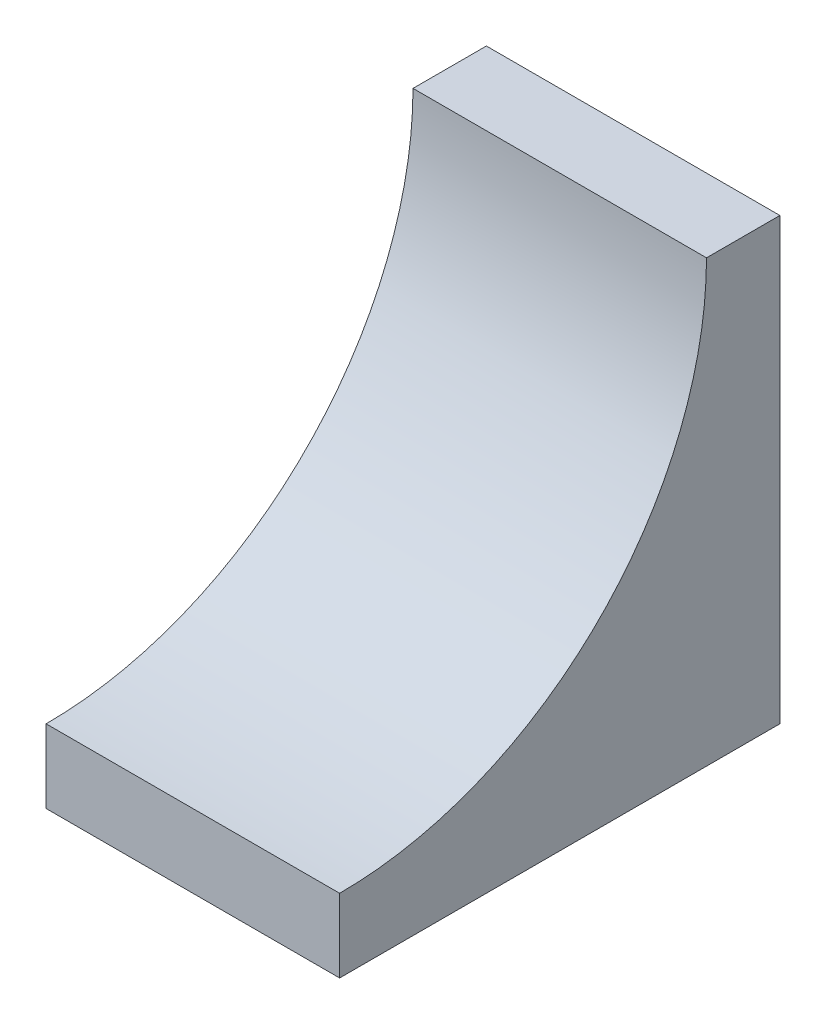
ISO-10303-21;
HEADER;
FILE_DESCRIPTION(('STEP AP214'),'2;1');
FILE_NAME('part.step','',(''),(''),'','','');
FILE_SCHEMA(('AUTOMOTIVE_DESIGN { 1 0 10303 214 1 1 1 1 }'));
ENDSEC;
DATA;
#1=APPLICATION_CONTEXT('core data for automotive mechanical design processes');
#2=APPLICATION_PROTOCOL_DEFINITION('international standard','automotive_design',2000,#1);
#3=PRODUCT_CONTEXT('',#1,'mechanical');
#4=PRODUCT('Part','Part','',(#3));
#5=PRODUCT_RELATED_PRODUCT_CATEGORY('part','',(#4));
#6=PRODUCT_DEFINITION_FORMATION('','',#4);
#7=PRODUCT_DEFINITION_CONTEXT('part definition',#1,'design');
#8=PRODUCT_DEFINITION('design','',#6,#7);
#9=PRODUCT_DEFINITION_SHAPE('','',#8);
#10=(LENGTH_UNIT() NAMED_UNIT(*) SI_UNIT(.MILLI.,.METRE.));
#11=(NAMED_UNIT(*) PLANE_ANGLE_UNIT() SI_UNIT($,.RADIAN.));
#12=(NAMED_UNIT(*) SI_UNIT($,.STERADIAN.) SOLID_ANGLE_UNIT());
#13=UNCERTAINTY_MEASURE_WITH_UNIT(LENGTH_MEASURE(1.E-05),#10,'distance_accuracy_value','');
#14=(GEOMETRIC_REPRESENTATION_CONTEXT(3) GLOBAL_UNCERTAINTY_ASSIGNED_CONTEXT((#13)) GLOBAL_UNIT_ASSIGNED_CONTEXT((#10,
#11,#12)) REPRESENTATION_CONTEXT('',''));
#15=CARTESIAN_POINT('',(0.,0.,0.));
#16=DIRECTION('',(0.,0.,1.));
#17=DIRECTION('',(1.,0.,0.));
#18=AXIS2_PLACEMENT_3D('',#15,#16,#17);
#19=CARTESIAN_POINT('',(6.35,19.05,0.));
#20=DIRECTION('',(0.,-1.,0.));
#21=DIRECTION('',(0.,0.,-1.));
#22=AXIS2_PLACEMENT_3D('',#19,#20,#21);
#23=PLANE('',#22);
#24=DIRECTION('',(0.,0.,1.));
#25=VECTOR('',#24,1.);
#26=CARTESIAN_POINT('',(-6.35,19.05,0.));
#27=LINE('',#26,#25);
#28=CARTESIAN_POINT('',(-6.35,19.05,0.));
#29=VERTEX_POINT('',#28);
#30=CARTESIAN_POINT('',(-6.35,19.05,3.175));
#31=VERTEX_POINT('',#30);
#32=EDGE_CURVE('E108',#29,#31,#27,.T.);
#33=ORIENTED_EDGE('',*,*,#32,.T.);
#34=DIRECTION('',(-1.,0.,0.));
#35=VECTOR('',#34,1.);
#36=CARTESIAN_POINT('',(6.35,19.05,3.175));
#37=LINE('',#36,#35);
#38=CARTESIAN_POINT('',(6.35,19.05,3.175));
#39=VERTEX_POINT('',#38);
#40=EDGE_CURVE('E11',#39,#31,#37,.T.);
#41=ORIENTED_EDGE('',*,*,#40,.F.);
#42=DIRECTION('',(0.,0.,1.));
#43=VECTOR('',#42,1.);
#44=CARTESIAN_POINT('',(6.35,19.05,0.));
#45=LINE('',#44,#43);
#46=CARTESIAN_POINT('',(6.35,19.05,0.));
#47=VERTEX_POINT('',#46);
#48=EDGE_CURVE('E116',#47,#39,#45,.T.);
#49=ORIENTED_EDGE('',*,*,#48,.F.);
#50=DIRECTION('',(-1.,0.,0.));
#51=VECTOR('',#50,1.);
#52=CARTESIAN_POINT('',(6.35,19.05,0.));
#53=LINE('',#52,#51);
#54=EDGE_CURVE('E104',#47,#29,#53,.T.);
#55=ORIENTED_EDGE('',*,*,#54,.T.);
#56=EDGE_LOOP('',(#33,#41,#49,#55));
#57=FACE_BOUND('',#56,.T.);
#58=ADVANCED_FACE('F34',(#57),#23,.F.);
#59=CARTESIAN_POINT('',(6.35,19.05,19.05));
#60=DIRECTION('',(-1.,0.,0.));
#61=DIRECTION('',(0.,0.,1.));
#62=AXIS2_PLACEMENT_3D('',#59,#60,#61);
#63=CYLINDRICAL_SURFACE('',#62,15.875);
#64=CARTESIAN_POINT('',(-6.35,19.05,19.05));
#65=DIRECTION('',(1.,0.,0.));
#66=DIRECTION('',(0.,0.,-1.));
#67=AXIS2_PLACEMENT_3D('',#64,#65,#66);
#68=CIRCLE('',#67,15.875);
#69=CARTESIAN_POINT('',(-6.35,3.175,19.05));
#70=VERTEX_POINT('',#69);
#71=EDGE_CURVE('E111',#31,#70,#68,.F.);
#72=ORIENTED_EDGE('',*,*,#71,.T.);
#73=DIRECTION('',(-1.,0.,0.));
#74=VECTOR('',#73,1.);
#75=CARTESIAN_POINT('',(6.35,3.175,19.05));
#76=LINE('',#75,#74);
#77=CARTESIAN_POINT('',(6.35,3.175,19.05));
#78=VERTEX_POINT('',#77);
#79=EDGE_CURVE('E42',#78,#70,#76,.T.);
#80=ORIENTED_EDGE('',*,*,#79,.F.);
#81=CARTESIAN_POINT('',(6.35,19.05,19.05));
#82=DIRECTION('',(1.,0.,0.));
#83=DIRECTION('',(0.,0.,-1.));
#84=AXIS2_PLACEMENT_3D('',#81,#82,#83);
#85=CIRCLE('',#84,15.875);
#86=EDGE_CURVE('E84',#39,#78,#85,.F.);
#87=ORIENTED_EDGE('',*,*,#86,.F.);
#88=ORIENTED_EDGE('',*,*,#40,.T.);
#89=EDGE_LOOP('',(#72,#80,#87,#88));
#90=FACE_BOUND('',#89,.T.);
#91=ADVANCED_FACE('F135',(#90),#63,.F.);
#92=CARTESIAN_POINT('',(6.35,0.,19.05));
#93=DIRECTION('',(0.,0.,-1.));
#94=DIRECTION('',(-1.,0.,0.));
#95=AXIS2_PLACEMENT_3D('',#92,#93,#94);
#96=PLANE('',#95);
#97=DIRECTION('',(0.,-1.,0.));
#98=VECTOR('',#97,1.);
#99=CARTESIAN_POINT('',(-6.35,0.,19.05));
#100=LINE('',#99,#98);
#101=CARTESIAN_POINT('',(-6.35,0.,19.05));
#102=VERTEX_POINT('',#101);
#103=EDGE_CURVE('E99',#70,#102,#100,.T.);
#104=ORIENTED_EDGE('',*,*,#103,.T.);
#105=DIRECTION('',(-1.,0.,0.));
#106=VECTOR('',#105,1.);
#107=CARTESIAN_POINT('',(6.35,0.,19.05));
#108=LINE('',#107,#106);
#109=CARTESIAN_POINT('',(6.35,0.,19.05));
#110=VERTEX_POINT('',#109);
#111=EDGE_CURVE('E96',#110,#102,#108,.T.);
#112=ORIENTED_EDGE('',*,*,#111,.F.);
#113=DIRECTION('',(0.,-1.,0.));
#114=VECTOR('',#113,1.);
#115=CARTESIAN_POINT('',(6.35,0.,19.05));
#116=LINE('',#115,#114);
#117=EDGE_CURVE('E88',#78,#110,#116,.T.);
#118=ORIENTED_EDGE('',*,*,#117,.F.);
#119=ORIENTED_EDGE('',*,*,#79,.T.);
#120=EDGE_LOOP('',(#104,#112,#118,#119));
#121=FACE_BOUND('',#120,.T.);
#122=ADVANCED_FACE('F97',(#121),#96,.F.);
#123=CARTESIAN_POINT('',(6.35,0.,0.));
#124=DIRECTION('',(0.,1.,0.));
#125=DIRECTION('',(0.,0.,1.));
#126=AXIS2_PLACEMENT_3D('',#123,#124,#125);
#127=PLANE('',#126);
#128=DIRECTION('',(0.,0.,-1.));
#129=VECTOR('',#128,1.);
#130=CARTESIAN_POINT('',(-6.35,0.,0.));
#131=LINE('',#130,#129);
#132=CARTESIAN_POINT('',(-6.35,0.,0.));
#133=VERTEX_POINT('',#132);
#134=EDGE_CURVE('E70',#102,#133,#131,.T.);
#135=ORIENTED_EDGE('',*,*,#134,.T.);
#136=DIRECTION('',(-1.,0.,0.));
#137=VECTOR('',#136,1.);
#138=CARTESIAN_POINT('',(6.35,0.,0.));
#139=LINE('',#138,#137);
#140=CARTESIAN_POINT('',(6.35,0.,0.));
#141=VERTEX_POINT('',#140);
#142=EDGE_CURVE('E100',#141,#133,#139,.T.);
#143=ORIENTED_EDGE('',*,*,#142,.F.);
#144=DIRECTION('',(0.,0.,-1.));
#145=VECTOR('',#144,1.);
#146=CARTESIAN_POINT('',(6.35,0.,0.));
#147=LINE('',#146,#145);
#148=EDGE_CURVE('E92',#110,#141,#147,.T.);
#149=ORIENTED_EDGE('',*,*,#148,.F.);
#150=ORIENTED_EDGE('',*,*,#111,.T.);
#151=EDGE_LOOP('',(#135,#143,#149,#150));
#152=FACE_BOUND('',#151,.T.);
#153=ADVANCED_FACE('F102',(#152),#127,.F.);
#154=CARTESIAN_POINT('',(6.35,0.,0.));
#155=DIRECTION('',(0.,0.,1.));
#156=DIRECTION('',(1.,0.,0.));
#157=AXIS2_PLACEMENT_3D('',#154,#155,#156);
#158=PLANE('',#157);
#159=DIRECTION('',(0.,1.,0.));
#160=VECTOR('',#159,1.);
#161=CARTESIAN_POINT('',(-6.35,0.,0.));
#162=LINE('',#161,#160);
#163=EDGE_CURVE('E76',#133,#29,#162,.T.);
#164=ORIENTED_EDGE('',*,*,#163,.T.);
#165=ORIENTED_EDGE('',*,*,#54,.F.);
#166=DIRECTION('',(0.,1.,0.));
#167=VECTOR('',#166,1.);
#168=CARTESIAN_POINT('',(6.35,0.,0.));
#169=LINE('',#168,#167);
#170=EDGE_CURVE('E50',#141,#47,#169,.T.);
#171=ORIENTED_EDGE('',*,*,#170,.F.);
#172=ORIENTED_EDGE('',*,*,#142,.T.);
#173=EDGE_LOOP('',(#164,#165,#171,#172));
#174=FACE_BOUND('',#173,.T.);
#175=ADVANCED_FACE('F124',(#174),#158,.F.);
#176=CARTESIAN_POINT('',(6.35,0.,0.));
#177=DIRECTION('',(1.,0.,0.));
#178=DIRECTION('',(0.,0.,-1.));
#179=AXIS2_PLACEMENT_3D('',#176,#177,#178);
#180=PLANE('',#179);
#181=ORIENTED_EDGE('',*,*,#48,.T.);
#182=ORIENTED_EDGE('',*,*,#86,.T.);
#183=ORIENTED_EDGE('',*,*,#117,.T.);
#184=ORIENTED_EDGE('',*,*,#148,.T.);
#185=ORIENTED_EDGE('',*,*,#170,.T.);
#186=EDGE_LOOP('',(#181,#182,#183,#184,#185));
#187=FACE_BOUND('',#186,.T.);
#188=ADVANCED_FACE('F90',(#187),#180,.T.);
#189=CARTESIAN_POINT('',(-6.35,0.,0.));
#190=DIRECTION('',(1.,0.,0.));
#191=DIRECTION('',(0.,0.,-1.));
#192=AXIS2_PLACEMENT_3D('',#189,#190,#191);
#193=PLANE('',#192);
#194=ORIENTED_EDGE('',*,*,#32,.F.);
#195=ORIENTED_EDGE('',*,*,#163,.F.);
#196=ORIENTED_EDGE('',*,*,#134,.F.);
#197=ORIENTED_EDGE('',*,*,#103,.F.);
#198=ORIENTED_EDGE('',*,*,#71,.F.);
#199=EDGE_LOOP('',(#194,#195,#196,#197,#198));
#200=FACE_BOUND('',#199,.T.);
#201=ADVANCED_FACE('F120',(#200),#193,.F.);
#202=CLOSED_SHELL('',(#58,#91,#122,#153,#175,#188,#201));
#203=MANIFOLD_SOLID_BREP('B2',#202);
#204=ADVANCED_BREP_SHAPE_REPRESENTATION('',(#18,#203),#14);
#205=SHAPE_DEFINITION_REPRESENTATION(#9,#204);
ENDSEC;
END-ISO-10303-21;
